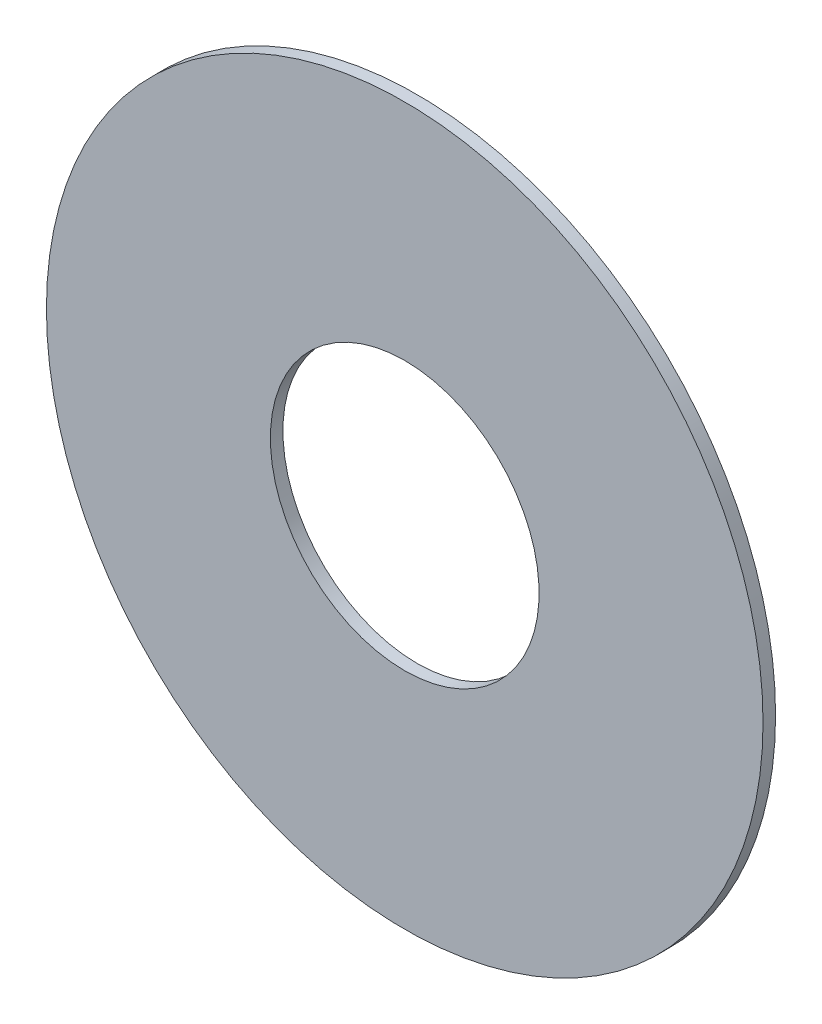
ISO-10303-21;
HEADER;
FILE_DESCRIPTION(('STEP AP214'),'2;1');
FILE_NAME('part.step','',(''),(''),'','','');
FILE_SCHEMA(('AUTOMOTIVE_DESIGN { 1 0 10303 214 1 1 1 1 }'));
ENDSEC;
DATA;
#1=APPLICATION_CONTEXT('core data for automotive mechanical design processes');
#2=APPLICATION_PROTOCOL_DEFINITION('international standard','automotive_design',2000,#1);
#3=PRODUCT_CONTEXT('',#1,'mechanical');
#4=PRODUCT('Part','Part','',(#3));
#5=PRODUCT_RELATED_PRODUCT_CATEGORY('part','',(#4));
#6=PRODUCT_DEFINITION_FORMATION('','',#4);
#7=PRODUCT_DEFINITION_CONTEXT('part definition',#1,'design');
#8=PRODUCT_DEFINITION('design','',#6,#7);
#9=PRODUCT_DEFINITION_SHAPE('','',#8);
#10=(LENGTH_UNIT() NAMED_UNIT(*) SI_UNIT(.MILLI.,.METRE.));
#11=(NAMED_UNIT(*) PLANE_ANGLE_UNIT() SI_UNIT($,.RADIAN.));
#12=(NAMED_UNIT(*) SI_UNIT($,.STERADIAN.) SOLID_ANGLE_UNIT());
#13=UNCERTAINTY_MEASURE_WITH_UNIT(LENGTH_MEASURE(1.E-05),#10,'distance_accuracy_value','');
#14=(GEOMETRIC_REPRESENTATION_CONTEXT(3) GLOBAL_UNCERTAINTY_ASSIGNED_CONTEXT((#13)) GLOBAL_UNIT_ASSIGNED_CONTEXT((#10,
#11,#12)) REPRESENTATION_CONTEXT('',''));
#15=CARTESIAN_POINT('',(0.,0.,0.));
#16=DIRECTION('',(0.,0.,1.));
#17=DIRECTION('',(1.,0.,0.));
#18=AXIS2_PLACEMENT_3D('',#15,#16,#17);
#19=CARTESIAN_POINT('',(146.304,-73.152,-0.045));
#20=DIRECTION('',(0.,0.,-1.));
#21=DIRECTION('',(0.,-1.,0.));
#22=AXIS2_PLACEMENT_3D('',#19,#20,#21);
#23=CYLINDRICAL_SURFACE('',#22,0.375);
#24=CARTESIAN_POINT('',(146.304,-73.152,1.67));
#25=DIRECTION('',(0.,0.,-1.));
#26=DIRECTION('',(0.,-1.,0.));
#27=AXIS2_PLACEMENT_3D('',#24,#25,#26);
#28=CIRCLE('',#27,0.375);
#29=CARTESIAN_POINT('',(146.304,-73.527,1.67));
#30=VERTEX_POINT('',#29);
#31=EDGE_CURVE('E25',#30,#30,#28,.T.);
#32=ORIENTED_EDGE('',*,*,#31,.T.);
#33=DIRECTION('',(0.,0.,1.));
#34=VECTOR('',#33,1.);
#35=CARTESIAN_POINT('',(146.304,-73.527,-0.045));
#36=LINE('',#35,#34);
#37=CARTESIAN_POINT('',(146.304,-73.527,1.705));
#38=VERTEX_POINT('',#37);
#39=EDGE_CURVE('E11',#30,#38,#36,.T.);
#40=ORIENTED_EDGE('',*,*,#39,.T.);
#41=CARTESIAN_POINT('',(146.304,-73.152,1.705));
#42=DIRECTION('',(0.,0.,-1.));
#43=DIRECTION('',(0.,-1.,0.));
#44=AXIS2_PLACEMENT_3D('',#41,#42,#43);
#45=CIRCLE('',#44,0.375);
#46=EDGE_CURVE('E68',#38,#38,#45,.T.);
#47=ORIENTED_EDGE('',*,*,#46,.F.);
#48=ORIENTED_EDGE('',*,*,#39,.F.);
#49=EDGE_LOOP('',(#32,#40,#47,#48));
#50=FACE_BOUND('',#49,.T.);
#51=ADVANCED_FACE('F17',(#50),#23,.F.);
#52=CARTESIAN_POINT('',(146.304,-73.152,1.67));
#53=DIRECTION('',(0.,0.,1.));
#54=DIRECTION('',(1.,0.,0.));
#55=AXIS2_PLACEMENT_3D('',#52,#53,#54);
#56=PLANE('',#55);
#57=ORIENTED_EDGE('',*,*,#31,.F.);
#58=EDGE_LOOP('',(#57));
#59=FACE_BOUND('',#58,.T.);
#60=CARTESIAN_POINT('',(146.304,-73.152,1.67));
#61=DIRECTION('',(0.,0.,1.));
#62=DIRECTION('',(1.,0.,0.));
#63=AXIS2_PLACEMENT_3D('',#60,#61,#62);
#64=CIRCLE('',#63,1.);
#65=CARTESIAN_POINT('',(147.304,-73.152,1.67));
#66=VERTEX_POINT('',#65);
#67=EDGE_CURVE('E56',#66,#66,#64,.T.);
#68=ORIENTED_EDGE('',*,*,#67,.F.);
#69=EDGE_LOOP('',(#68));
#70=FACE_BOUND('',#69,.T.);
#71=ADVANCED_FACE('F76',(#59,#70),#56,.F.);
#72=CARTESIAN_POINT('',(146.304,-73.152,1.705));
#73=DIRECTION('',(0.,0.,1.));
#74=DIRECTION('',(1.,0.,0.));
#75=AXIS2_PLACEMENT_3D('',#72,#73,#74);
#76=PLANE('',#75);
#77=ORIENTED_EDGE('',*,*,#46,.T.);
#78=EDGE_LOOP('',(#77));
#79=FACE_BOUND('',#78,.T.);
#80=CARTESIAN_POINT('',(146.304,-73.152,1.705));
#81=DIRECTION('',(0.,0.,1.));
#82=DIRECTION('',(1.,0.,0.));
#83=AXIS2_PLACEMENT_3D('',#80,#81,#82);
#84=CIRCLE('',#83,1.);
#85=CARTESIAN_POINT('',(147.304,-73.152,1.705));
#86=VERTEX_POINT('',#85);
#87=EDGE_CURVE('E54',#86,#86,#84,.T.);
#88=ORIENTED_EDGE('',*,*,#87,.T.);
#89=EDGE_LOOP('',(#88));
#90=FACE_BOUND('',#89,.T.);
#91=ADVANCED_FACE('F60',(#79,#90),#76,.T.);
#92=CARTESIAN_POINT('',(146.304,-73.152,1.67));
#93=DIRECTION('',(0.,0.,1.));
#94=DIRECTION('',(1.,0.,0.));
#95=AXIS2_PLACEMENT_3D('',#92,#93,#94);
#96=CYLINDRICAL_SURFACE('',#95,1.);
#97=ORIENTED_EDGE('',*,*,#87,.F.);
#98=DIRECTION('',(0.,0.,1.));
#99=VECTOR('',#98,1.);
#100=CARTESIAN_POINT('',(147.304,-73.152,1.67));
#101=LINE('',#100,#99);
#102=EDGE_CURVE('E51',#66,#86,#101,.T.);
#103=ORIENTED_EDGE('',*,*,#102,.F.);
#104=ORIENTED_EDGE('',*,*,#67,.T.);
#105=ORIENTED_EDGE('',*,*,#102,.T.);
#106=EDGE_LOOP('',(#97,#103,#104,#105));
#107=FACE_BOUND('',#106,.T.);
#108=ADVANCED_FACE('F53',(#107),#96,.T.);
#109=CLOSED_SHELL('',(#51,#71,#91,#108));
#110=MANIFOLD_SOLID_BREP('B1',#109);
#111=ADVANCED_BREP_SHAPE_REPRESENTATION('',(#18,#110),#14);
#112=SHAPE_DEFINITION_REPRESENTATION(#9,#111);
ENDSEC;
END-ISO-10303-21;
